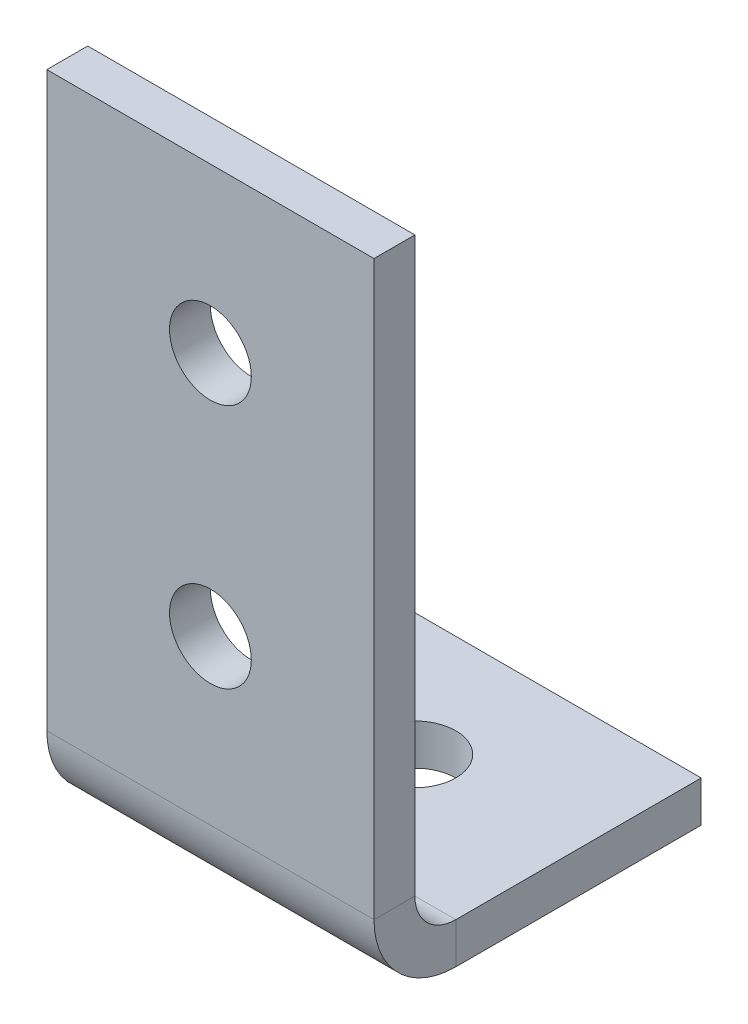
ISO-10303-21;
HEADER;
FILE_DESCRIPTION(('STEP AP214'),'2;1');
FILE_NAME('part.step','',(''),(''),'','','');
FILE_SCHEMA(('AUTOMOTIVE_DESIGN { 1 0 10303 214 1 1 1 1 }'));
ENDSEC;
DATA;
#1=APPLICATION_CONTEXT('core data for automotive mechanical design processes');
#2=APPLICATION_PROTOCOL_DEFINITION('international standard','automotive_design',2000,#1);
#3=PRODUCT_CONTEXT('',#1,'mechanical');
#4=PRODUCT('Part','Part','',(#3));
#5=PRODUCT_RELATED_PRODUCT_CATEGORY('part','',(#4));
#6=PRODUCT_DEFINITION_FORMATION('','',#4);
#7=PRODUCT_DEFINITION_CONTEXT('part definition',#1,'design');
#8=PRODUCT_DEFINITION('design','',#6,#7);
#9=PRODUCT_DEFINITION_SHAPE('','',#8);
#10=(LENGTH_UNIT() NAMED_UNIT(*) SI_UNIT(.MILLI.,.METRE.));
#11=(NAMED_UNIT(*) PLANE_ANGLE_UNIT() SI_UNIT($,.RADIAN.));
#12=(NAMED_UNIT(*) SI_UNIT($,.STERADIAN.) SOLID_ANGLE_UNIT());
#13=UNCERTAINTY_MEASURE_WITH_UNIT(LENGTH_MEASURE(1.E-05),#10,'distance_accuracy_value','');
#14=(GEOMETRIC_REPRESENTATION_CONTEXT(3) GLOBAL_UNCERTAINTY_ASSIGNED_CONTEXT((#13)) GLOBAL_UNIT_ASSIGNED_CONTEXT((#10,
#11,#12)) REPRESENTATION_CONTEXT('',''));
#15=CARTESIAN_POINT('',(0.,0.,0.));
#16=DIRECTION('',(0.,0.,1.));
#17=DIRECTION('',(1.,0.,0.));
#18=AXIS2_PLACEMENT_3D('',#15,#16,#17);
#19=CARTESIAN_POINT('',(25.4,6.35,25.4));
#20=DIRECTION('',(1.,0.,0.));
#21=DIRECTION('',(0.,0.,-1.));
#22=AXIS2_PLACEMENT_3D('',#19,#20,#21);
#23=PLANE('',#22);
#24=DIRECTION('',(0.,0.,-1.));
#25=VECTOR('',#24,1.);
#26=CARTESIAN_POINT('',(25.4,6.35,25.4));
#27=LINE('',#26,#25);
#28=CARTESIAN_POINT('',(25.4,6.35,25.4));
#29=VERTEX_POINT('',#28);
#30=CARTESIAN_POINT('',(25.4,6.35,22.225));
#31=VERTEX_POINT('',#30);
#32=EDGE_CURVE('E11',#29,#31,#27,.T.);
#33=ORIENTED_EDGE('',*,*,#32,.F.);
#34=CARTESIAN_POINT('',(25.4,6.35,19.05));
#35=DIRECTION('',(1.,0.,0.));
#36=DIRECTION('',(0.,0.,-1.));
#37=AXIS2_PLACEMENT_3D('',#34,#35,#36);
#38=CIRCLE('',#37,6.35);
#39=CARTESIAN_POINT('',(25.4,0.,19.05));
#40=VERTEX_POINT('',#39);
#41=EDGE_CURVE('E140',#40,#29,#38,.F.);
#42=ORIENTED_EDGE('',*,*,#41,.F.);
#43=DIRECTION('',(0.,-1.,0.));
#44=VECTOR('',#43,1.);
#45=CARTESIAN_POINT('',(25.4,3.175,19.05));
#46=LINE('',#45,#44);
#47=CARTESIAN_POINT('',(25.4,3.175,19.05));
#48=VERTEX_POINT('',#47);
#49=EDGE_CURVE('E51',#48,#40,#46,.T.);
#50=ORIENTED_EDGE('',*,*,#49,.F.);
#51=CARTESIAN_POINT('',(25.4,6.35,19.05));
#52=DIRECTION('',(1.,0.,0.));
#53=DIRECTION('',(0.,0.,-1.));
#54=AXIS2_PLACEMENT_3D('',#51,#52,#53);
#55=CIRCLE('',#54,3.175);
#56=EDGE_CURVE('E133',#48,#31,#55,.F.);
#57=ORIENTED_EDGE('',*,*,#56,.T.);
#58=EDGE_LOOP('',(#33,#42,#50,#57));
#59=FACE_BOUND('',#58,.T.);
#60=ADVANCED_FACE('F43',(#59),#23,.T.);
#61=CARTESIAN_POINT('',(25.4,3.175,19.05));
#62=DIRECTION('',(1.,0.,0.));
#63=DIRECTION('',(0.,0.,-1.));
#64=AXIS2_PLACEMENT_3D('',#61,#62,#63);
#65=PLANE('',#64);
#66=DIRECTION('',(0.,1.,0.));
#67=VECTOR('',#66,1.);
#68=CARTESIAN_POINT('',(25.4,0.,25.4));
#69=LINE('',#68,#67);
#70=CARTESIAN_POINT('',(25.4,50.8,25.4));
#71=VERTEX_POINT('',#70);
#72=EDGE_CURVE('E190',#29,#71,#69,.T.);
#73=ORIENTED_EDGE('',*,*,#72,.F.);
#74=ORIENTED_EDGE('',*,*,#32,.T.);
#75=DIRECTION('',(0.,1.,0.));
#76=VECTOR('',#75,1.);
#77=CARTESIAN_POINT('',(25.4,0.,22.225));
#78=LINE('',#77,#76);
#79=CARTESIAN_POINT('',(25.4,50.8,22.225));
#80=VERTEX_POINT('',#79);
#81=EDGE_CURVE('E99',#31,#80,#78,.T.);
#82=ORIENTED_EDGE('',*,*,#81,.T.);
#83=DIRECTION('',(0.,0.,-1.));
#84=VECTOR('',#83,1.);
#85=CARTESIAN_POINT('',(25.4,50.8,25.4));
#86=LINE('',#85,#84);
#87=EDGE_CURVE('E382',#71,#80,#86,.T.);
#88=ORIENTED_EDGE('',*,*,#87,.F.);
#89=EDGE_LOOP('',(#73,#74,#82,#88));
#90=FACE_BOUND('',#89,.T.);
#91=ADVANCED_FACE('F198',(#90),#65,.T.);
#92=CARTESIAN_POINT('',(0.,0.,19.05));
#93=DIRECTION('',(-1.,0.,0.));
#94=DIRECTION('',(0.,0.,1.));
#95=AXIS2_PLACEMENT_3D('',#92,#93,#94);
#96=PLANE('',#95);
#97=DIRECTION('',(0.,1.,0.));
#98=VECTOR('',#97,1.);
#99=CARTESIAN_POINT('',(0.,0.,19.05));
#100=LINE('',#99,#98);
#101=CARTESIAN_POINT('',(0.,0.,19.05));
#102=VERTEX_POINT('',#101);
#103=CARTESIAN_POINT('',(0.,3.175,19.05));
#104=VERTEX_POINT('',#103);
#105=EDGE_CURVE('E86',#102,#104,#100,.T.);
#106=ORIENTED_EDGE('',*,*,#105,.F.);
#107=CARTESIAN_POINT('',(0.,6.35,19.05));
#108=DIRECTION('',(1.,0.,0.));
#109=DIRECTION('',(0.,0.,-1.));
#110=AXIS2_PLACEMENT_3D('',#107,#108,#109);
#111=CIRCLE('',#110,6.35);
#112=CARTESIAN_POINT('',(0.,6.35,25.4));
#113=VERTEX_POINT('',#112);
#114=EDGE_CURVE('E156',#102,#113,#111,.F.);
#115=ORIENTED_EDGE('',*,*,#114,.T.);
#116=DIRECTION('',(0.,0.,1.));
#117=VECTOR('',#116,1.);
#118=CARTESIAN_POINT('',(0.,6.35,22.225));
#119=LINE('',#118,#117);
#120=CARTESIAN_POINT('',(0.,6.35,22.225));
#121=VERTEX_POINT('',#120);
#122=EDGE_CURVE('E93',#121,#113,#119,.T.);
#123=ORIENTED_EDGE('',*,*,#122,.F.);
#124=CARTESIAN_POINT('',(0.,6.35,19.05));
#125=DIRECTION('',(1.,0.,0.));
#126=DIRECTION('',(0.,0.,-1.));
#127=AXIS2_PLACEMENT_3D('',#124,#125,#126);
#128=CIRCLE('',#127,3.175);
#129=EDGE_CURVE('E163',#104,#121,#128,.F.);
#130=ORIENTED_EDGE('',*,*,#129,.F.);
#131=EDGE_LOOP('',(#106,#115,#123,#130));
#132=FACE_BOUND('',#131,.T.);
#133=ADVANCED_FACE('F196',(#132),#96,.T.);
#134=CARTESIAN_POINT('',(0.,6.35,22.225));
#135=DIRECTION('',(-1.,0.,0.));
#136=DIRECTION('',(0.,0.,1.));
#137=AXIS2_PLACEMENT_3D('',#134,#135,#136);
#138=PLANE('',#137);
#139=DIRECTION('',(0.,0.,1.));
#140=VECTOR('',#139,1.);
#141=CARTESIAN_POINT('',(0.,0.,0.));
#142=LINE('',#141,#140);
#143=CARTESIAN_POINT('',(0.,0.,0.));
#144=VERTEX_POINT('',#143);
#145=EDGE_CURVE('E158',#144,#102,#142,.T.);
#146=ORIENTED_EDGE('',*,*,#145,.T.);
#147=ORIENTED_EDGE('',*,*,#105,.T.);
#148=DIRECTION('',(0.,0.,-1.));
#149=VECTOR('',#148,1.);
#150=CARTESIAN_POINT('',(0.,3.175,0.));
#151=LINE('',#150,#149);
#152=CARTESIAN_POINT('',(0.,3.175,0.));
#153=VERTEX_POINT('',#152);
#154=EDGE_CURVE('E161',#153,#104,#151,.F.);
#155=ORIENTED_EDGE('',*,*,#154,.F.);
#156=DIRECTION('',(0.,-1.,0.));
#157=VECTOR('',#156,1.);
#158=CARTESIAN_POINT('',(0.,3.175,0.));
#159=LINE('',#158,#157);
#160=EDGE_CURVE('E121',#153,#144,#159,.T.);
#161=ORIENTED_EDGE('',*,*,#160,.T.);
#162=EDGE_LOOP('',(#146,#147,#155,#161));
#163=FACE_BOUND('',#162,.T.);
#164=ADVANCED_FACE('F192',(#163),#138,.T.);
#165=CARTESIAN_POINT('',(25.4,0.,22.225));
#166=DIRECTION('',(0.,0.,1.));
#167=DIRECTION('',(1.,0.,0.));
#168=AXIS2_PLACEMENT_3D('',#165,#166,#167);
#169=PLANE('',#168);
#170=CARTESIAN_POINT('',(12.7,38.1,22.225));
#171=DIRECTION('',(0.,0.,-1.));
#172=DIRECTION('',(-1.,0.,0.));
#173=AXIS2_PLACEMENT_3D('',#170,#171,#172);
#174=CIRCLE('',#173,3.175);
#175=CARTESIAN_POINT('',(9.525,38.1,22.225));
#176=VERTEX_POINT('',#175);
#177=EDGE_CURVE('E368',#176,#176,#174,.T.);
#178=ORIENTED_EDGE('',*,*,#177,.F.);
#179=EDGE_LOOP('',(#178));
#180=FACE_BOUND('',#179,.T.);
#181=CARTESIAN_POINT('',(12.7,19.05,22.225));
#182=DIRECTION('',(0.,0.,-1.));
#183=DIRECTION('',(-1.,0.,0.));
#184=AXIS2_PLACEMENT_3D('',#181,#182,#183);
#185=CIRCLE('',#184,3.175);
#186=CARTESIAN_POINT('',(9.525,19.05,22.225));
#187=VERTEX_POINT('',#186);
#188=EDGE_CURVE('E376',#187,#187,#185,.T.);
#189=ORIENTED_EDGE('',*,*,#188,.F.);
#190=EDGE_LOOP('',(#189));
#191=FACE_BOUND('',#190,.T.);
#192=DIRECTION('',(0.,1.,0.));
#193=VECTOR('',#192,1.);
#194=CARTESIAN_POINT('',(0.,0.,22.225));
#195=LINE('',#194,#193);
#196=CARTESIAN_POINT('',(0.,50.8,22.225));
#197=VERTEX_POINT('',#196);
#198=EDGE_CURVE('E146',#121,#197,#195,.T.);
#199=ORIENTED_EDGE('',*,*,#198,.T.);
#200=DIRECTION('',(-1.,0.,0.));
#201=VECTOR('',#200,1.);
#202=CARTESIAN_POINT('',(25.4,50.8,22.225));
#203=LINE('',#202,#201);
#204=EDGE_CURVE('E177',#80,#197,#203,.T.);
#205=ORIENTED_EDGE('',*,*,#204,.F.);
#206=ORIENTED_EDGE('',*,*,#81,.F.);
#207=DIRECTION('',(-1.,0.,0.));
#208=VECTOR('',#207,1.);
#209=CARTESIAN_POINT('',(25.4,6.35,22.225));
#210=LINE('',#209,#208);
#211=EDGE_CURVE('E145',#31,#121,#210,.T.);
#212=ORIENTED_EDGE('',*,*,#211,.T.);
#213=EDGE_LOOP('',(#199,#205,#206,#212));
#214=FACE_BOUND('',#213,.T.);
#215=ADVANCED_FACE('F204',(#180,#191,#214),#169,.F.);
#216=CARTESIAN_POINT('',(25.4,50.8,25.4));
#217=DIRECTION('',(0.,1.,0.));
#218=DIRECTION('',(0.,0.,1.));
#219=AXIS2_PLACEMENT_3D('',#216,#217,#218);
#220=PLANE('',#219);
#221=DIRECTION('',(0.,0.,-1.));
#222=VECTOR('',#221,1.);
#223=CARTESIAN_POINT('',(0.,50.8,25.4));
#224=LINE('',#223,#222);
#225=CARTESIAN_POINT('',(0.,50.8,25.4));
#226=VERTEX_POINT('',#225);
#227=EDGE_CURVE('E149',#226,#197,#224,.T.);
#228=ORIENTED_EDGE('',*,*,#227,.F.);
#229=DIRECTION('',(-1.,0.,0.));
#230=VECTOR('',#229,1.);
#231=CARTESIAN_POINT('',(25.4,50.8,25.4));
#232=LINE('',#231,#230);
#233=EDGE_CURVE('E175',#71,#226,#232,.T.);
#234=ORIENTED_EDGE('',*,*,#233,.F.);
#235=ORIENTED_EDGE('',*,*,#87,.T.);
#236=ORIENTED_EDGE('',*,*,#204,.T.);
#237=EDGE_LOOP('',(#228,#234,#235,#236));
#238=FACE_BOUND('',#237,.T.);
#239=ADVANCED_FACE('F238',(#238),#220,.T.);
#240=CARTESIAN_POINT('',(25.4,0.,25.4));
#241=DIRECTION('',(0.,0.,1.));
#242=DIRECTION('',(1.,0.,0.));
#243=AXIS2_PLACEMENT_3D('',#240,#241,#242);
#244=PLANE('',#243);
#245=CARTESIAN_POINT('',(12.7,38.1,25.4));
#246=DIRECTION('',(0.,0.,1.));
#247=DIRECTION('',(1.,0.,0.));
#248=AXIS2_PLACEMENT_3D('',#245,#246,#247);
#249=CIRCLE('',#248,3.175);
#250=CARTESIAN_POINT('',(15.875,38.1,25.4));
#251=VERTEX_POINT('',#250);
#252=EDGE_CURVE('E373',#251,#251,#249,.T.);
#253=ORIENTED_EDGE('',*,*,#252,.F.);
#254=EDGE_LOOP('',(#253));
#255=FACE_BOUND('',#254,.T.);
#256=CARTESIAN_POINT('',(12.7,19.05,25.4));
#257=DIRECTION('',(0.,0.,1.));
#258=DIRECTION('',(1.,0.,0.));
#259=AXIS2_PLACEMENT_3D('',#256,#257,#258);
#260=CIRCLE('',#259,3.175);
#261=CARTESIAN_POINT('',(15.875,19.05,25.4));
#262=VERTEX_POINT('',#261);
#263=EDGE_CURVE('E150',#262,#262,#260,.T.);
#264=ORIENTED_EDGE('',*,*,#263,.F.);
#265=EDGE_LOOP('',(#264));
#266=FACE_BOUND('',#265,.T.);
#267=DIRECTION('',(0.,1.,0.));
#268=VECTOR('',#267,1.);
#269=CARTESIAN_POINT('',(0.,0.,25.4));
#270=LINE('',#269,#268);
#271=EDGE_CURVE('E153',#113,#226,#270,.T.);
#272=ORIENTED_EDGE('',*,*,#271,.F.);
#273=DIRECTION('',(-1.,0.,0.));
#274=VECTOR('',#273,1.);
#275=CARTESIAN_POINT('',(25.4,6.35,25.4));
#276=LINE('',#275,#274);
#277=EDGE_CURVE('E172',#29,#113,#276,.T.);
#278=ORIENTED_EDGE('',*,*,#277,.F.);
#279=ORIENTED_EDGE('',*,*,#72,.T.);
#280=ORIENTED_EDGE('',*,*,#233,.T.);
#281=EDGE_LOOP('',(#272,#278,#279,#280));
#282=FACE_BOUND('',#281,.T.);
#283=ADVANCED_FACE('F250',(#255,#266,#282),#244,.T.);
#284=CARTESIAN_POINT('',(25.4,6.35,19.05));
#285=DIRECTION('',(-1.,0.,0.));
#286=DIRECTION('',(0.,0.,1.));
#287=AXIS2_PLACEMENT_3D('',#284,#285,#286);
#288=CYLINDRICAL_SURFACE('',#287,6.35);
#289=ORIENTED_EDGE('',*,*,#114,.F.);
#290=DIRECTION('',(-1.,0.,0.));
#291=VECTOR('',#290,1.);
#292=CARTESIAN_POINT('',(25.4,0.,19.05));
#293=LINE('',#292,#291);
#294=EDGE_CURVE('E169',#40,#102,#293,.T.);
#295=ORIENTED_EDGE('',*,*,#294,.F.);
#296=ORIENTED_EDGE('',*,*,#41,.T.);
#297=ORIENTED_EDGE('',*,*,#277,.T.);
#298=EDGE_LOOP('',(#289,#295,#296,#297));
#299=FACE_BOUND('',#298,.T.);
#300=ADVANCED_FACE('F186',(#299),#288,.T.);
#301=CARTESIAN_POINT('',(25.4,0.,0.));
#302=DIRECTION('',(0.,-1.,0.));
#303=DIRECTION('',(0.,0.,-1.));
#304=AXIS2_PLACEMENT_3D('',#301,#302,#303);
#305=PLANE('',#304);
#306=CARTESIAN_POINT('',(12.7,0.,9.525));
#307=DIRECTION('',(0.,-1.,0.));
#308=DIRECTION('',(0.,0.,-1.));
#309=AXIS2_PLACEMENT_3D('',#306,#307,#308);
#310=CIRCLE('',#309,3.17499999999999);
#311=CARTESIAN_POINT('',(12.7,0.,6.35000000000001));
#312=VERTEX_POINT('',#311);
#313=EDGE_CURVE('E363',#312,#312,#310,.T.);
#314=ORIENTED_EDGE('',*,*,#313,.F.);
#315=EDGE_LOOP('',(#314));
#316=FACE_BOUND('',#315,.T.);
#317=ORIENTED_EDGE('',*,*,#145,.F.);
#318=DIRECTION('',(-1.,0.,0.));
#319=VECTOR('',#318,1.);
#320=CARTESIAN_POINT('',(25.4,0.,0.));
#321=LINE('',#320,#319);
#322=CARTESIAN_POINT('',(25.4,0.,0.));
#323=VERTEX_POINT('',#322);
#324=EDGE_CURVE('E123',#323,#144,#321,.T.);
#325=ORIENTED_EDGE('',*,*,#324,.F.);
#326=DIRECTION('',(0.,0.,1.));
#327=VECTOR('',#326,1.);
#328=CARTESIAN_POINT('',(25.4,0.,0.));
#329=LINE('',#328,#327);
#330=EDGE_CURVE('E138',#323,#40,#329,.T.);
#331=ORIENTED_EDGE('',*,*,#330,.T.);
#332=ORIENTED_EDGE('',*,*,#294,.T.);
#333=EDGE_LOOP('',(#317,#325,#331,#332));
#334=FACE_BOUND('',#333,.T.);
#335=ADVANCED_FACE('F191',(#316,#334),#305,.T.);
#336=CARTESIAN_POINT('',(25.4,3.175,0.));
#337=DIRECTION('',(0.,0.,-1.));
#338=DIRECTION('',(-1.,0.,0.));
#339=AXIS2_PLACEMENT_3D('',#336,#337,#338);
#340=PLANE('',#339);
#341=ORIENTED_EDGE('',*,*,#160,.F.);
#342=DIRECTION('',(-1.,0.,0.));
#343=VECTOR('',#342,1.);
#344=CARTESIAN_POINT('',(25.4,3.175,0.));
#345=LINE('',#344,#343);
#346=CARTESIAN_POINT('',(25.4,3.175,0.));
#347=VERTEX_POINT('',#346);
#348=EDGE_CURVE('E115',#347,#153,#345,.T.);
#349=ORIENTED_EDGE('',*,*,#348,.F.);
#350=DIRECTION('',(0.,-1.,0.));
#351=VECTOR('',#350,1.);
#352=CARTESIAN_POINT('',(25.4,3.175,0.));
#353=LINE('',#352,#351);
#354=EDGE_CURVE('E119',#347,#323,#353,.T.);
#355=ORIENTED_EDGE('',*,*,#354,.T.);
#356=ORIENTED_EDGE('',*,*,#324,.T.);
#357=EDGE_LOOP('',(#341,#349,#355,#356));
#358=FACE_BOUND('',#357,.T.);
#359=ADVANCED_FACE('F117',(#358),#340,.T.);
#360=CARTESIAN_POINT('',(25.4,3.175,0.));
#361=DIRECTION('',(0.,-1.,0.));
#362=DIRECTION('',(0.,0.,-1.));
#363=AXIS2_PLACEMENT_3D('',#360,#361,#362);
#364=PLANE('',#363);
#365=CARTESIAN_POINT('',(12.7,3.175,9.525));
#366=DIRECTION('',(0.,1.,0.));
#367=DIRECTION('',(0.,0.,1.));
#368=AXIS2_PLACEMENT_3D('',#365,#366,#367);
#369=CIRCLE('',#368,3.17499999999999);
#370=CARTESIAN_POINT('',(12.7,3.175,12.7));
#371=VERTEX_POINT('',#370);
#372=EDGE_CURVE('E366',#371,#371,#369,.T.);
#373=ORIENTED_EDGE('',*,*,#372,.F.);
#374=EDGE_LOOP('',(#373));
#375=FACE_BOUND('',#374,.T.);
#376=ORIENTED_EDGE('',*,*,#154,.T.);
#377=DIRECTION('',(-1.,0.,0.));
#378=VECTOR('',#377,1.);
#379=CARTESIAN_POINT('',(25.4,3.175,19.05));
#380=LINE('',#379,#378);
#381=EDGE_CURVE('E124',#48,#104,#380,.T.);
#382=ORIENTED_EDGE('',*,*,#381,.F.);
#383=DIRECTION('',(0.,0.,-1.));
#384=VECTOR('',#383,1.);
#385=CARTESIAN_POINT('',(25.4,3.175,0.));
#386=LINE('',#385,#384);
#387=EDGE_CURVE('E128',#347,#48,#386,.F.);
#388=ORIENTED_EDGE('',*,*,#387,.F.);
#389=ORIENTED_EDGE('',*,*,#348,.T.);
#390=EDGE_LOOP('',(#376,#382,#388,#389));
#391=FACE_BOUND('',#390,.T.);
#392=ADVANCED_FACE('F129',(#375,#391),#364,.F.);
#393=CARTESIAN_POINT('',(25.4,6.35,19.05));
#394=DIRECTION('',(-1.,0.,0.));
#395=DIRECTION('',(0.,0.,1.));
#396=AXIS2_PLACEMENT_3D('',#393,#394,#395);
#397=CYLINDRICAL_SURFACE('',#396,3.175);
#398=ORIENTED_EDGE('',*,*,#129,.T.);
#399=ORIENTED_EDGE('',*,*,#211,.F.);
#400=ORIENTED_EDGE('',*,*,#56,.F.);
#401=ORIENTED_EDGE('',*,*,#381,.T.);
#402=EDGE_LOOP('',(#398,#399,#400,#401));
#403=FACE_BOUND('',#402,.T.);
#404=ADVANCED_FACE('F194',(#403),#397,.F.);
#405=CARTESIAN_POINT('',(25.4,6.35,19.05));
#406=DIRECTION('',(1.,0.,0.));
#407=DIRECTION('',(0.,0.,-1.));
#408=AXIS2_PLACEMENT_3D('',#405,#406,#407);
#409=PLANE('',#408);
#410=ORIENTED_EDGE('',*,*,#387,.T.);
#411=ORIENTED_EDGE('',*,*,#49,.T.);
#412=ORIENTED_EDGE('',*,*,#330,.F.);
#413=ORIENTED_EDGE('',*,*,#354,.F.);
#414=EDGE_LOOP('',(#410,#411,#412,#413));
#415=FACE_BOUND('',#414,.T.);
#416=ADVANCED_FACE('F136',(#415),#409,.T.);
#417=CARTESIAN_POINT('',(0.,6.35,19.05));
#418=DIRECTION('',(1.,0.,0.));
#419=DIRECTION('',(0.,0.,-1.));
#420=AXIS2_PLACEMENT_3D('',#417,#418,#419);
#421=PLANE('',#420);
#422=ORIENTED_EDGE('',*,*,#198,.F.);
#423=ORIENTED_EDGE('',*,*,#122,.T.);
#424=ORIENTED_EDGE('',*,*,#271,.T.);
#425=ORIENTED_EDGE('',*,*,#227,.T.);
#426=EDGE_LOOP('',(#422,#423,#424,#425));
#427=FACE_BOUND('',#426,.T.);
#428=ADVANCED_FACE('F320',(#427),#421,.F.);
#429=CARTESIAN_POINT('',(12.7,19.05,22.225));
#430=DIRECTION('',(0.,0.,-1.));
#431=DIRECTION('',(-1.,0.,0.));
#432=AXIS2_PLACEMENT_3D('',#429,#430,#431);
#433=CYLINDRICAL_SURFACE('',#432,3.175);
#434=ORIENTED_EDGE('',*,*,#263,.T.);
#435=EDGE_LOOP('',(#434));
#436=FACE_BOUND('',#435,.T.);
#437=ORIENTED_EDGE('',*,*,#188,.T.);
#438=EDGE_LOOP('',(#437));
#439=FACE_BOUND('',#438,.T.);
#440=ADVANCED_FACE('F329',(#436,#439),#433,.F.);
#441=CARTESIAN_POINT('',(12.7,38.1,22.225));
#442=DIRECTION('',(0.,0.,-1.));
#443=DIRECTION('',(-1.,0.,0.));
#444=AXIS2_PLACEMENT_3D('',#441,#442,#443);
#445=CYLINDRICAL_SURFACE('',#444,3.175);
#446=ORIENTED_EDGE('',*,*,#252,.T.);
#447=EDGE_LOOP('',(#446));
#448=FACE_BOUND('',#447,.T.);
#449=ORIENTED_EDGE('',*,*,#177,.T.);
#450=EDGE_LOOP('',(#449));
#451=FACE_BOUND('',#450,.T.);
#452=ADVANCED_FACE('F339',(#448,#451),#445,.F.);
#453=CARTESIAN_POINT('',(12.7,3.175,9.525));
#454=DIRECTION('',(0.,1.,0.));
#455=DIRECTION('',(0.,0.,1.));
#456=AXIS2_PLACEMENT_3D('',#453,#454,#455);
#457=CYLINDRICAL_SURFACE('',#456,3.17499999999999);
#458=ORIENTED_EDGE('',*,*,#313,.T.);
#459=EDGE_LOOP('',(#458));
#460=FACE_BOUND('',#459,.T.);
#461=ORIENTED_EDGE('',*,*,#372,.T.);
#462=EDGE_LOOP('',(#461));
#463=FACE_BOUND('',#462,.T.);
#464=ADVANCED_FACE('F348',(#460,#463),#457,.F.);
#465=CLOSED_SHELL('',(#60,#91,#133,#164,#215,#239,#283,#300,#335,#359,#392,#404,#416,#428,#440,
#452,#464));
#466=MANIFOLD_SOLID_BREP('B2',#465);
#467=ADVANCED_BREP_SHAPE_REPRESENTATION('',(#18,#466),#14);
#468=SHAPE_DEFINITION_REPRESENTATION(#9,#467);
ENDSEC;
END-ISO-10303-21;
